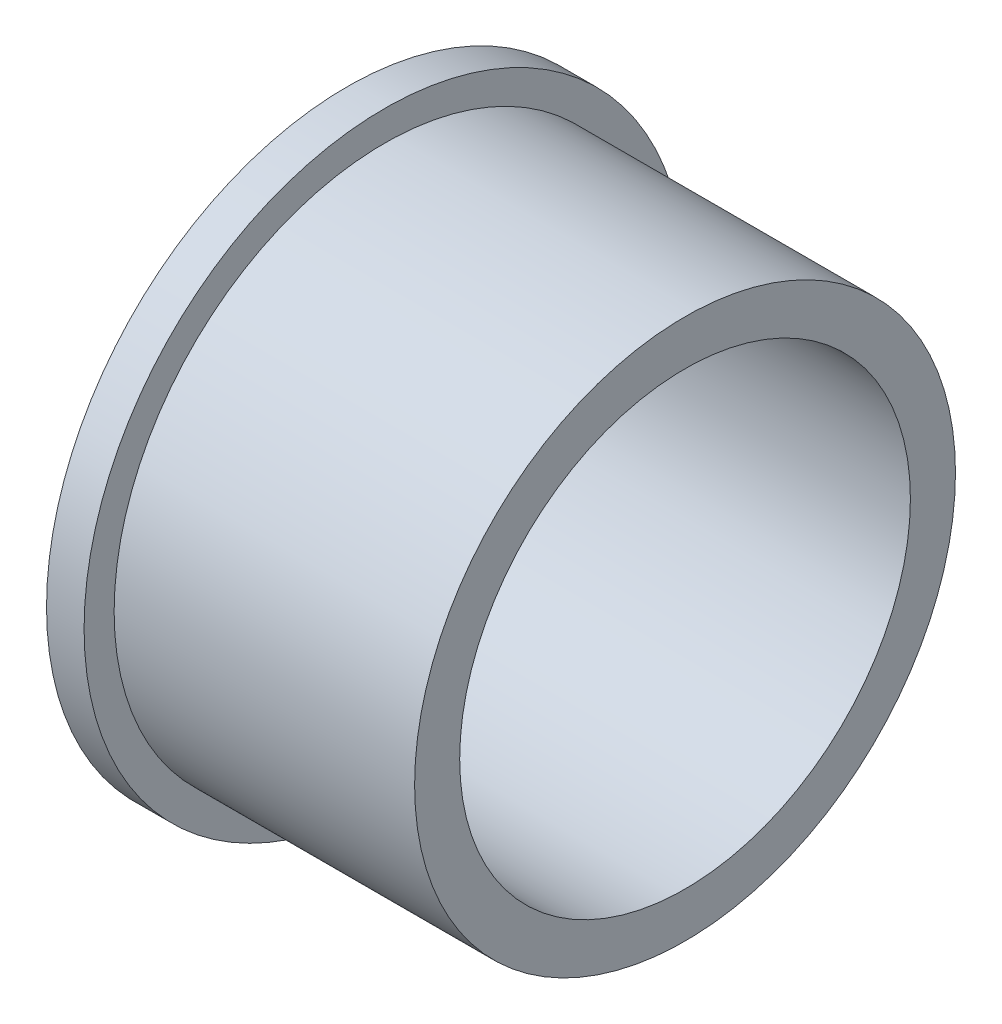
ISO-10303-21;
HEADER;
FILE_DESCRIPTION(('STEP AP214'),'2;1');
FILE_NAME('part.step','',(''),(''),'','','');
FILE_SCHEMA(('AUTOMOTIVE_DESIGN { 1 0 10303 214 1 1 1 1 }'));
ENDSEC;
DATA;
#1=APPLICATION_CONTEXT('core data for automotive mechanical design processes');
#2=APPLICATION_PROTOCOL_DEFINITION('international standard','automotive_design',2000,#1);
#3=PRODUCT_CONTEXT('',#1,'mechanical');
#4=PRODUCT('Part','Part','',(#3));
#5=PRODUCT_RELATED_PRODUCT_CATEGORY('part','',(#4));
#6=PRODUCT_DEFINITION_FORMATION('','',#4);
#7=PRODUCT_DEFINITION_CONTEXT('part definition',#1,'design');
#8=PRODUCT_DEFINITION('design','',#6,#7);
#9=PRODUCT_DEFINITION_SHAPE('','',#8);
#10=(LENGTH_UNIT() NAMED_UNIT(*) SI_UNIT(.MILLI.,.METRE.));
#11=(NAMED_UNIT(*) PLANE_ANGLE_UNIT() SI_UNIT($,.RADIAN.));
#12=(NAMED_UNIT(*) SI_UNIT($,.STERADIAN.) SOLID_ANGLE_UNIT());
#13=UNCERTAINTY_MEASURE_WITH_UNIT(LENGTH_MEASURE(1.E-05),#10,'distance_accuracy_value','');
#14=(GEOMETRIC_REPRESENTATION_CONTEXT(3) GLOBAL_UNCERTAINTY_ASSIGNED_CONTEXT((#13)) GLOBAL_UNIT_ASSIGNED_CONTEXT((#10,
#11,#12)) REPRESENTATION_CONTEXT('',''));
#15=CARTESIAN_POINT('',(0.,0.,0.));
#16=DIRECTION('',(0.,0.,1.));
#17=DIRECTION('',(1.,0.,0.));
#18=AXIS2_PLACEMENT_3D('',#15,#16,#17);
#19=CARTESIAN_POINT('',(-84.410714624,0.,0.));
#20=DIRECTION('',(-1.,0.,0.));
#21=DIRECTION('',(0.,0.,1.));
#22=AXIS2_PLACEMENT_3D('',#19,#20,#21);
#23=CYLINDRICAL_SURFACE('',#22,20.);
#24=CARTESIAN_POINT('',(0.,0.,0.));
#25=DIRECTION('',(-1.,0.,0.));
#26=DIRECTION('',(0.,0.,1.));
#27=AXIS2_PLACEMENT_3D('',#24,#25,#26);
#28=CIRCLE('',#27,20.);
#29=CARTESIAN_POINT('',(0.,0.,20.));
#30=VERTEX_POINT('',#29);
#31=EDGE_CURVE('E10',#30,#30,#28,.T.);
#32=ORIENTED_EDGE('',*,*,#31,.F.);
#33=EDGE_LOOP('',(#32));
#34=FACE_BOUND('',#33,.T.);
#35=CARTESIAN_POINT('',(2.5,0.,0.));
#36=DIRECTION('',(-1.,0.,0.));
#37=DIRECTION('',(0.,0.,1.));
#38=AXIS2_PLACEMENT_3D('',#35,#36,#37);
#39=CIRCLE('',#38,20.);
#40=CARTESIAN_POINT('',(2.5,0.,20.));
#41=VERTEX_POINT('',#40);
#42=EDGE_CURVE('E56',#41,#41,#39,.T.);
#43=ORIENTED_EDGE('',*,*,#42,.T.);
#44=EDGE_LOOP('',(#43));
#45=FACE_BOUND('',#44,.T.);
#46=ADVANCED_FACE('F34',(#34,#45),#23,.T.);
#47=CARTESIAN_POINT('',(0.,20.,0.));
#48=DIRECTION('',(1.,0.,0.));
#49=DIRECTION('',(0.,0.,-1.));
#50=AXIS2_PLACEMENT_3D('',#47,#48,#49);
#51=PLANE('',#50);
#52=CARTESIAN_POINT('',(0.,0.,0.));
#53=DIRECTION('',(-1.,0.,0.));
#54=DIRECTION('',(0.,0.,1.));
#55=AXIS2_PLACEMENT_3D('',#52,#53,#54);
#56=CIRCLE('',#55,15.);
#57=CARTESIAN_POINT('',(0.,0.,15.));
#58=VERTEX_POINT('',#57);
#59=EDGE_CURVE('E40',#58,#58,#56,.T.);
#60=ORIENTED_EDGE('',*,*,#59,.F.);
#61=EDGE_LOOP('',(#60));
#62=FACE_BOUND('',#61,.T.);
#63=ORIENTED_EDGE('',*,*,#31,.T.);
#64=EDGE_LOOP('',(#63));
#65=FACE_BOUND('',#64,.T.);
#66=ADVANCED_FACE('F81',(#62,#65),#51,.F.);
#67=CARTESIAN_POINT('',(-84.410714624,0.,0.));
#68=DIRECTION('',(-1.,0.,0.));
#69=DIRECTION('',(0.,0.,1.));
#70=AXIS2_PLACEMENT_3D('',#67,#68,#69);
#71=CYLINDRICAL_SURFACE('',#70,15.);
#72=CARTESIAN_POINT('',(22.5,0.,0.));
#73=DIRECTION('',(-1.,0.,0.));
#74=DIRECTION('',(0.,0.,1.));
#75=AXIS2_PLACEMENT_3D('',#72,#73,#74);
#76=CIRCLE('',#75,15.);
#77=CARTESIAN_POINT('',(22.5,0.,15.));
#78=VERTEX_POINT('',#77);
#79=EDGE_CURVE('E44',#78,#78,#76,.T.);
#80=ORIENTED_EDGE('',*,*,#79,.F.);
#81=EDGE_LOOP('',(#80));
#82=FACE_BOUND('',#81,.T.);
#83=ORIENTED_EDGE('',*,*,#59,.T.);
#84=EDGE_LOOP('',(#83));
#85=FACE_BOUND('',#84,.T.);
#86=ADVANCED_FACE('F76',(#82,#85),#71,.F.);
#87=CARTESIAN_POINT('',(22.5,15.,0.));
#88=DIRECTION('',(-1.,0.,0.));
#89=DIRECTION('',(0.,0.,1.));
#90=AXIS2_PLACEMENT_3D('',#87,#88,#89);
#91=PLANE('',#90);
#92=CARTESIAN_POINT('',(22.5,0.,0.));
#93=DIRECTION('',(-1.,0.,0.));
#94=DIRECTION('',(0.,0.,1.));
#95=AXIS2_PLACEMENT_3D('',#92,#93,#94);
#96=CIRCLE('',#95,18.);
#97=CARTESIAN_POINT('',(22.5,0.,18.));
#98=VERTEX_POINT('',#97);
#99=EDGE_CURVE('E48',#98,#98,#96,.T.);
#100=ORIENTED_EDGE('',*,*,#99,.F.);
#101=EDGE_LOOP('',(#100));
#102=FACE_BOUND('',#101,.T.);
#103=ORIENTED_EDGE('',*,*,#79,.T.);
#104=EDGE_LOOP('',(#103));
#105=FACE_BOUND('',#104,.T.);
#106=ADVANCED_FACE('F70',(#102,#105),#91,.F.);
#107=CARTESIAN_POINT('',(-84.410714624,0.,0.));
#108=DIRECTION('',(-1.,0.,0.));
#109=DIRECTION('',(0.,0.,1.));
#110=AXIS2_PLACEMENT_3D('',#107,#108,#109);
#111=CYLINDRICAL_SURFACE('',#110,18.);
#112=CARTESIAN_POINT('',(2.5,0.,0.));
#113=DIRECTION('',(-1.,0.,0.));
#114=DIRECTION('',(0.,0.,1.));
#115=AXIS2_PLACEMENT_3D('',#112,#113,#114);
#116=CIRCLE('',#115,18.);
#117=CARTESIAN_POINT('',(2.5,0.,18.));
#118=VERTEX_POINT('',#117);
#119=EDGE_CURVE('E53',#118,#118,#116,.T.);
#120=ORIENTED_EDGE('',*,*,#119,.F.);
#121=EDGE_LOOP('',(#120));
#122=FACE_BOUND('',#121,.T.);
#123=ORIENTED_EDGE('',*,*,#99,.T.);
#124=EDGE_LOOP('',(#123));
#125=FACE_BOUND('',#124,.T.);
#126=ADVANCED_FACE('F64',(#122,#125),#111,.T.);
#127=CARTESIAN_POINT('',(2.5,18.,0.));
#128=DIRECTION('',(-1.,0.,0.));
#129=DIRECTION('',(0.,0.,1.));
#130=AXIS2_PLACEMENT_3D('',#127,#128,#129);
#131=PLANE('',#130);
#132=ORIENTED_EDGE('',*,*,#42,.F.);
#133=EDGE_LOOP('',(#132));
#134=FACE_BOUND('',#133,.T.);
#135=ORIENTED_EDGE('',*,*,#119,.T.);
#136=EDGE_LOOP('',(#135));
#137=FACE_BOUND('',#136,.T.);
#138=ADVANCED_FACE('F61',(#134,#137),#131,.F.);
#139=CLOSED_SHELL('',(#46,#66,#86,#106,#126,#138));
#140=MANIFOLD_SOLID_BREP('B2',#139);
#141=ADVANCED_BREP_SHAPE_REPRESENTATION('',(#18,#140),#14);
#142=SHAPE_DEFINITION_REPRESENTATION(#9,#141);
ENDSEC;
END-ISO-10303-21;
